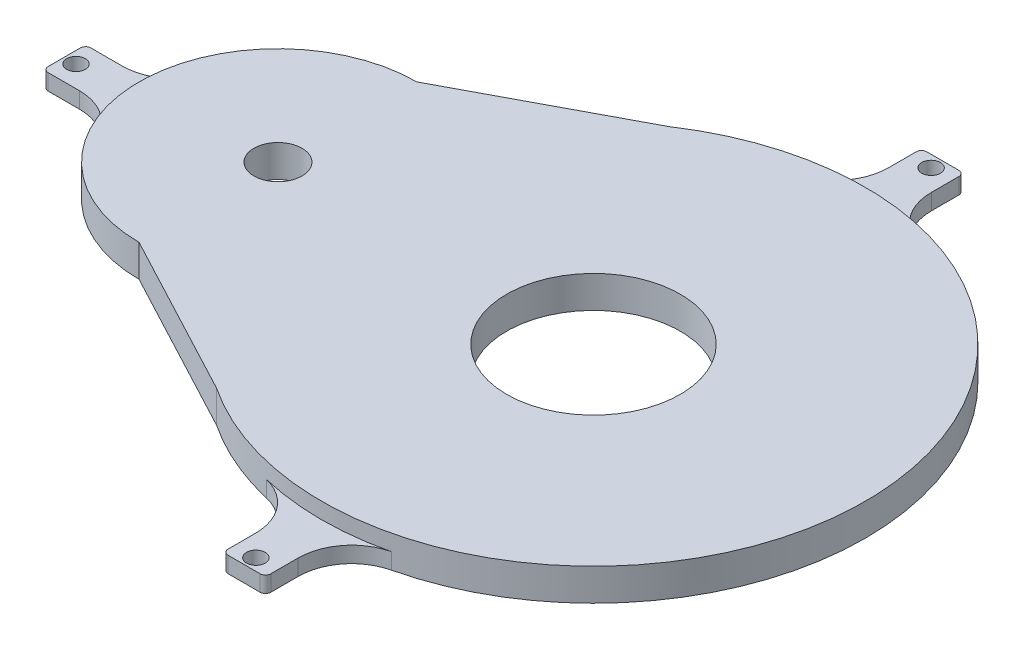
ISO-10303-21;
HEADER;
FILE_DESCRIPTION(('STEP AP214'),'2;1');
FILE_NAME('part.step','',(''),(''),'','','');
FILE_SCHEMA(('AUTOMOTIVE_DESIGN { 1 0 10303 214 1 1 1 1 }'));
ENDSEC;
DATA;
#1=APPLICATION_CONTEXT('core data for automotive mechanical design processes');
#2=APPLICATION_PROTOCOL_DEFINITION('international standard','automotive_design',2000,#1);
#3=PRODUCT_CONTEXT('',#1,'mechanical');
#4=PRODUCT('Part','Part','',(#3));
#5=PRODUCT_RELATED_PRODUCT_CATEGORY('part','',(#4));
#6=PRODUCT_DEFINITION_FORMATION('','',#4);
#7=PRODUCT_DEFINITION_CONTEXT('part definition',#1,'design');
#8=PRODUCT_DEFINITION('design','',#6,#7);
#9=PRODUCT_DEFINITION_SHAPE('','',#8);
#10=(LENGTH_UNIT() NAMED_UNIT(*) SI_UNIT(.MILLI.,.METRE.));
#11=(NAMED_UNIT(*) PLANE_ANGLE_UNIT() SI_UNIT($,.RADIAN.));
#12=(NAMED_UNIT(*) SI_UNIT($,.STERADIAN.) SOLID_ANGLE_UNIT());
#13=UNCERTAINTY_MEASURE_WITH_UNIT(LENGTH_MEASURE(1.E-05),#10,'distance_accuracy_value','');
#14=(GEOMETRIC_REPRESENTATION_CONTEXT(3) GLOBAL_UNCERTAINTY_ASSIGNED_CONTEXT((#13)) GLOBAL_UNIT_ASSIGNED_CONTEXT((#10,
#11,#12)) REPRESENTATION_CONTEXT('',''));
#15=CARTESIAN_POINT('',(0.,0.,0.));
#16=DIRECTION('',(0.,0.,1.));
#17=DIRECTION('',(1.,0.,0.));
#18=AXIS2_PLACEMENT_3D('',#15,#16,#17);
#19=CARTESIAN_POINT('',(0.,6.,0.));
#20=DIRECTION('',(0.,1.,0.));
#21=DIRECTION('',(0.,0.,1.));
#22=AXIS2_PLACEMENT_3D('',#19,#20,#21);
#23=PLANE('',#22);
#24=CARTESIAN_POINT('',(31.9089246812045,6.,-7.07485149033878));
#25=DIRECTION('',(0.,1.,0.));
#26=DIRECTION('',(0.,0.,1.));
#27=AXIS2_PLACEMENT_3D('',#24,#25,#26);
#28=CIRCLE('',#27,16.25);
#29=CARTESIAN_POINT('',(31.9089246812045,6.,9.17514850966123));
#30=VERTEX_POINT('',#29);
#31=EDGE_CURVE('E530',#30,#30,#28,.F.);
#32=ORIENTED_EDGE('',*,*,#31,.T.);
#33=EDGE_LOOP('',(#32));
#34=FACE_BOUND('',#33,.T.);
#35=CARTESIAN_POINT('',(-27.1460753187955,6.,-7.07485149033878));
#36=DIRECTION('',(0.,1.,0.));
#37=DIRECTION('',(0.,0.,1.));
#38=AXIS2_PLACEMENT_3D('',#35,#36,#37);
#39=CIRCLE('',#38,4.5);
#40=CARTESIAN_POINT('',(-27.1460753187955,6.,-2.57485149033878));
#41=VERTEX_POINT('',#40);
#42=EDGE_CURVE('E300',#41,#41,#39,.T.);
#43=ORIENTED_EDGE('',*,*,#42,.F.);
#44=EDGE_LOOP('',(#43));
#45=FACE_BOUND('',#44,.T.);
#46=CARTESIAN_POINT('',(31.9089246812045,6.,-7.07485149033878));
#47=DIRECTION('',(0.,1.,0.));
#48=DIRECTION('',(0.,0.,1.));
#49=AXIS2_PLACEMENT_3D('',#46,#47,#48);
#50=CIRCLE('',#49,50.89);
#51=CARTESIAN_POINT('',(3.70624919259435,6.,35.2855214457456));
#52=VERTEX_POINT('',#51);
#53=CARTESIAN_POINT('',(3.70624919259435,6.,-49.4352244264231));
#54=VERTEX_POINT('',#53);
#55=EDGE_CURVE('E270',#52,#54,#50,.T.);
#56=ORIENTED_EDGE('',*,*,#55,.T.);
#57=DIRECTION('',(0.883470496277917,0.,-0.468486800461283));
#58=VECTOR('',#57,1.);
#59=CARTESIAN_POINT('',(-19.6475087974022,6.,-37.051191902898));
#60=LINE('',#59,#58);
#61=CARTESIAN_POINT('',(-27.1460753187955,6.,-33.0748514903388));
#62=VERTEX_POINT('',#61);
#63=EDGE_CURVE('E274',#62,#54,#60,.T.);
#64=ORIENTED_EDGE('',*,*,#63,.F.);
#65=CARTESIAN_POINT('',(-27.1460753187955,6.,-7.07485149033878));
#66=DIRECTION('',(0.,1.,0.));
#67=DIRECTION('',(0.,0.,1.));
#68=AXIS2_PLACEMENT_3D('',#65,#66,#67);
#69=CIRCLE('',#68,26.);
#70=CARTESIAN_POINT('',(-27.1460753187955,6.,18.9251485096612));
#71=VERTEX_POINT('',#70);
#72=EDGE_CURVE('E294',#71,#62,#69,.F.);
#73=ORIENTED_EDGE('',*,*,#72,.F.);
#74=DIRECTION('',(0.883470496277918,0.,0.468486800461283));
#75=VECTOR('',#74,1.);
#76=CARTESIAN_POINT('',(-13.7910278666367,6.,26.0070640656758));
#77=LINE('',#76,#75);
#78=EDGE_CURVE('E276',#71,#52,#77,.T.);
#79=ORIENTED_EDGE('',*,*,#78,.T.);
#80=EDGE_LOOP('',(#56,#64,#73,#79));
#81=FACE_BOUND('',#80,.T.);
#82=ADVANCED_FACE('F83',(#34,#45,#81),#23,.T.);
#83=CARTESIAN_POINT('',(0.,0.,0.));
#84=DIRECTION('',(0.,1.,0.));
#85=DIRECTION('',(0.,0.,1.));
#86=AXIS2_PLACEMENT_3D('',#83,#84,#85);
#87=PLANE('',#86);
#88=CARTESIAN_POINT('',(31.9089246812045,0.,-7.07485149033878));
#89=DIRECTION('',(0.,1.,0.));
#90=DIRECTION('',(0.,0.,1.));
#91=AXIS2_PLACEMENT_3D('',#88,#89,#90);
#92=CIRCLE('',#91,16.25);
#93=CARTESIAN_POINT('',(31.9089246812045,0.,9.17514850966123));
#94=VERTEX_POINT('',#93);
#95=EDGE_CURVE('E534',#94,#94,#92,.T.);
#96=ORIENTED_EDGE('',*,*,#95,.T.);
#97=EDGE_LOOP('',(#96));
#98=FACE_BOUND('',#97,.T.);
#99=CARTESIAN_POINT('',(31.9089246812043,0.,-70.2648514903388));
#100=DIRECTION('',(0.,1.,0.));
#101=DIRECTION('',(0.,0.,1.));
#102=AXIS2_PLACEMENT_3D('',#99,#100,#101);
#103=CIRCLE('',#102,1.75);
#104=CARTESIAN_POINT('',(31.9089246812043,0.,-68.5148514903388));
#105=VERTEX_POINT('',#104);
#106=EDGE_CURVE('E466',#105,#105,#103,.T.);
#107=ORIENTED_EDGE('',*,*,#106,.T.);
#108=EDGE_LOOP('',(#107));
#109=FACE_BOUND('',#108,.T.);
#110=CARTESIAN_POINT('',(31.9089246812047,0.,56.1151485096612));
#111=DIRECTION('',(0.,1.,0.));
#112=DIRECTION('',(0.,0.,1.));
#113=AXIS2_PLACEMENT_3D('',#110,#111,#112);
#114=CIRCLE('',#113,1.75);
#115=CARTESIAN_POINT('',(31.9089246812047,0.,57.8651485096612));
#116=VERTEX_POINT('',#115);
#117=EDGE_CURVE('E479',#116,#116,#114,.T.);
#118=ORIENTED_EDGE('',*,*,#117,.T.);
#119=EDGE_LOOP('',(#118));
#120=FACE_BOUND('',#119,.T.);
#121=CARTESIAN_POINT('',(-27.1460753187955,0.,-7.07485149033878));
#122=DIRECTION('',(0.,1.,0.));
#123=DIRECTION('',(0.,0.,1.));
#124=AXIS2_PLACEMENT_3D('',#121,#122,#123);
#125=CIRCLE('',#124,4.5);
#126=CARTESIAN_POINT('',(-27.1460753187955,0.,-2.57485149033878));
#127=VERTEX_POINT('',#126);
#128=EDGE_CURVE('E278',#127,#127,#125,.T.);
#129=ORIENTED_EDGE('',*,*,#128,.T.);
#130=EDGE_LOOP('',(#129));
#131=FACE_BOUND('',#130,.T.);
#132=CARTESIAN_POINT('',(-64.9460753161257,0.,-7.07485149033877));
#133=DIRECTION('',(0.,1.,0.));
#134=DIRECTION('',(0.,0.,1.));
#135=AXIS2_PLACEMENT_3D('',#132,#133,#134);
#136=CIRCLE('',#135,1.75);
#137=CARTESIAN_POINT('',(-64.9460753161257,0.,-5.32485149033877));
#138=VERTEX_POINT('',#137);
#139=EDGE_CURVE('E491',#138,#138,#136,.T.);
#140=ORIENTED_EDGE('',*,*,#139,.T.);
#141=EDGE_LOOP('',(#140));
#142=FACE_BOUND('',#141,.T.);
#143=CARTESIAN_POINT('',(31.9089246812045,0.,-7.07485149033878));
#144=DIRECTION('',(0.,1.,0.));
#145=DIRECTION('',(0.,0.,1.));
#146=AXIS2_PLACEMENT_3D('',#143,#144,#145);
#147=CIRCLE('',#146,50.89);
#148=CARTESIAN_POINT('',(43.6096965649292,0.,42.4517478005982));
#149=VERTEX_POINT('',#148);
#150=CARTESIAN_POINT('',(43.6096965649292,0.,-56.6014507812757));
#151=VERTEX_POINT('',#150);
#152=EDGE_CURVE('E308',#149,#151,#147,.T.);
#153=ORIENTED_EDGE('',*,*,#152,.F.);
#154=CARTESIAN_POINT('',(45.9089246812045,0.,52.1838364802871));
#155=DIRECTION('',(0.,1.,0.));
#156=DIRECTION('',(0.,0.,1.));
#157=AXIS2_PLACEMENT_3D('',#154,#155,#156);
#158=CIRCLE('',#157,10.);
#159=CARTESIAN_POINT('',(35.9089246812045,0.,52.1838364802871));
#160=VERTEX_POINT('',#159);
#161=EDGE_CURVE('E421',#149,#160,#158,.T.);
#162=ORIENTED_EDGE('',*,*,#161,.T.);
#163=DIRECTION('',(0.,0.,-1.));
#164=VECTOR('',#163,1.);
#165=CARTESIAN_POINT('',(35.9089246812045,0.,0.));
#166=LINE('',#165,#164);
#167=CARTESIAN_POINT('',(35.9089246812045,0.,57.3151485096612));
#168=VERTEX_POINT('',#167);
#169=EDGE_CURVE('E482',#168,#160,#166,.T.);
#170=ORIENTED_EDGE('',*,*,#169,.F.);
#171=CARTESIAN_POINT('',(34.9089246812045,0.,57.3151485096612));
#172=DIRECTION('',(0.,1.,0.));
#173=DIRECTION('',(0.,0.,1.));
#174=AXIS2_PLACEMENT_3D('',#171,#172,#173);
#175=CIRCLE('',#174,1.);
#176=CARTESIAN_POINT('',(34.9089246812045,0.,58.3151485096612));
#177=VERTEX_POINT('',#176);
#178=EDGE_CURVE('E337',#168,#177,#175,.F.);
#179=ORIENTED_EDGE('',*,*,#178,.T.);
#180=DIRECTION('',(-1.,0.,0.));
#181=VECTOR('',#180,1.);
#182=CARTESIAN_POINT('',(0.,0.,58.3151485096612));
#183=LINE('',#182,#181);
#184=CARTESIAN_POINT('',(28.9089246812045,0.,58.3151485096612));
#185=VERTEX_POINT('',#184);
#186=EDGE_CURVE('E488',#177,#185,#183,.T.);
#187=ORIENTED_EDGE('',*,*,#186,.T.);
#188=CARTESIAN_POINT('',(28.9089246812045,0.,57.3151485096612));
#189=DIRECTION('',(0.,1.,0.));
#190=DIRECTION('',(0.,0.,1.));
#191=AXIS2_PLACEMENT_3D('',#188,#189,#190);
#192=CIRCLE('',#191,1.);
#193=CARTESIAN_POINT('',(27.9089246812045,0.,57.3151485096612));
#194=VERTEX_POINT('',#193);
#195=EDGE_CURVE('E339',#185,#194,#192,.F.);
#196=ORIENTED_EDGE('',*,*,#195,.T.);
#197=DIRECTION('',(0.,0.,-1.));
#198=VECTOR('',#197,1.);
#199=CARTESIAN_POINT('',(27.9089246812045,0.,0.));
#200=LINE('',#199,#198);
#201=CARTESIAN_POINT('',(27.9089246812045,0.,52.1838364802871));
#202=VERTEX_POINT('',#201);
#203=EDGE_CURVE('E485',#194,#202,#200,.T.);
#204=ORIENTED_EDGE('',*,*,#203,.T.);
#205=CARTESIAN_POINT('',(17.9089246812045,0.,52.1838364802871));
#206=DIRECTION('',(0.,1.,0.));
#207=DIRECTION('',(0.,0.,1.));
#208=AXIS2_PLACEMENT_3D('',#205,#206,#207);
#209=CIRCLE('',#208,10.);
#210=CARTESIAN_POINT('',(20.2081527974797,0.,42.4517478005982));
#211=VERTEX_POINT('',#210);
#212=EDGE_CURVE('E416',#202,#211,#209,.T.);
#213=ORIENTED_EDGE('',*,*,#212,.T.);
#214=CARTESIAN_POINT('',(3.70624919259435,0.,35.2855214457456));
#215=VERTEX_POINT('',#214);
#216=EDGE_CURVE('E304',#215,#211,#147,.T.);
#217=ORIENTED_EDGE('',*,*,#216,.F.);
#218=DIRECTION('',(0.883470496277918,0.,0.468486800461283));
#219=VECTOR('',#218,1.);
#220=CARTESIAN_POINT('',(-13.7910278666367,0.,26.0070640656758));
#221=LINE('',#220,#219);
#222=CARTESIAN_POINT('',(-27.1460753187955,0.,18.9251485096612));
#223=VERTEX_POINT('',#222);
#224=EDGE_CURVE('E313',#223,#215,#221,.T.);
#225=ORIENTED_EDGE('',*,*,#224,.F.);
#226=CARTESIAN_POINT('',(-27.1460753187955,0.,-7.07485149033878));
#227=DIRECTION('',(0.,1.,0.));
#228=DIRECTION('',(0.,0.,1.));
#229=AXIS2_PLACEMENT_3D('',#226,#227,#228);
#230=CIRCLE('',#229,26.);
#231=CARTESIAN_POINT('',(-51.0994765824735,0.,3.0362596207722));
#232=VERTEX_POINT('',#231);
#233=EDGE_CURVE('E311',#223,#232,#230,.F.);
#234=ORIENTED_EDGE('',*,*,#233,.T.);
#235=CARTESIAN_POINT('',(-60.3123232223496,0.,6.92514850966104));
#236=DIRECTION('',(0.,1.,0.));
#237=DIRECTION('',(0.,0.,1.));
#238=AXIS2_PLACEMENT_3D('',#235,#236,#237);
#239=CIRCLE('',#238,10.);
#240=CARTESIAN_POINT('',(-60.3123232223496,0.,-3.07485149033896));
#241=VERTEX_POINT('',#240);
#242=EDGE_CURVE('E12',#232,#241,#239,.T.);
#243=ORIENTED_EDGE('',*,*,#242,.T.);
#244=DIRECTION('',(1.,0.,0.));
#245=VECTOR('',#244,1.);
#246=CARTESIAN_POINT('',(0.,0.,-3.07485149033896));
#247=LINE('',#246,#245);
#248=CARTESIAN_POINT('',(-66.1460753161257,0.,-3.07485149033896));
#249=VERTEX_POINT('',#248);
#250=EDGE_CURVE('E494',#249,#241,#247,.T.);
#251=ORIENTED_EDGE('',*,*,#250,.F.);
#252=CARTESIAN_POINT('',(-66.1460753161257,0.,-4.07485149033896));
#253=DIRECTION('',(0.,1.,0.));
#254=DIRECTION('',(0.,0.,1.));
#255=AXIS2_PLACEMENT_3D('',#252,#253,#254);
#256=CIRCLE('',#255,1.);
#257=CARTESIAN_POINT('',(-67.1460753161257,0.,-4.07485149033896));
#258=VERTEX_POINT('',#257);
#259=EDGE_CURVE('E335',#249,#258,#256,.F.);
#260=ORIENTED_EDGE('',*,*,#259,.T.);
#261=DIRECTION('',(0.,0.,-1.));
#262=VECTOR('',#261,1.);
#263=CARTESIAN_POINT('',(-67.1460753161257,0.,0.));
#264=LINE('',#263,#262);
#265=CARTESIAN_POINT('',(-67.1460753161257,0.,-10.074851490339));
#266=VERTEX_POINT('',#265);
#267=EDGE_CURVE('E496',#258,#266,#264,.T.);
#268=ORIENTED_EDGE('',*,*,#267,.T.);
#269=CARTESIAN_POINT('',(-66.1460753161257,0.,-10.074851490339));
#270=DIRECTION('',(0.,1.,0.));
#271=DIRECTION('',(0.,0.,1.));
#272=AXIS2_PLACEMENT_3D('',#269,#270,#271);
#273=CIRCLE('',#272,1.);
#274=CARTESIAN_POINT('',(-66.1460753161257,0.,-11.074851490339));
#275=VERTEX_POINT('',#274);
#276=EDGE_CURVE('E333',#266,#275,#273,.F.);
#277=ORIENTED_EDGE('',*,*,#276,.T.);
#278=DIRECTION('',(1.,0.,0.));
#279=VECTOR('',#278,1.);
#280=CARTESIAN_POINT('',(0.,0.,-11.074851490339));
#281=LINE('',#280,#279);
#282=CARTESIAN_POINT('',(-60.3123232223494,0.,-11.074851490339));
#283=VERTEX_POINT('',#282);
#284=EDGE_CURVE('E448',#275,#283,#281,.T.);
#285=ORIENTED_EDGE('',*,*,#284,.T.);
#286=CARTESIAN_POINT('',(-60.3123232223494,0.,-21.074851490339));
#287=DIRECTION('',(0.,1.,0.));
#288=DIRECTION('',(0.,0.,1.));
#289=AXIS2_PLACEMENT_3D('',#286,#287,#288);
#290=CIRCLE('',#289,10.);
#291=CARTESIAN_POINT('',(-51.0994765824733,0.,-17.18596260145));
#292=VERTEX_POINT('',#291);
#293=EDGE_CURVE('E425',#283,#292,#290,.T.);
#294=ORIENTED_EDGE('',*,*,#293,.T.);
#295=CARTESIAN_POINT('',(-27.1460753187955,0.,-33.0748514903388));
#296=VERTEX_POINT('',#295);
#297=EDGE_CURVE('E310',#292,#296,#230,.F.);
#298=ORIENTED_EDGE('',*,*,#297,.T.);
#299=DIRECTION('',(0.883470496277917,0.,-0.468486800461283));
#300=VECTOR('',#299,1.);
#301=CARTESIAN_POINT('',(-19.6475087974022,0.,-37.051191902898));
#302=LINE('',#301,#300);
#303=CARTESIAN_POINT('',(3.70624919259435,0.,-49.4352244264231));
#304=VERTEX_POINT('',#303);
#305=EDGE_CURVE('E307',#296,#304,#302,.T.);
#306=ORIENTED_EDGE('',*,*,#305,.T.);
#307=CARTESIAN_POINT('',(20.2081527974797,0.,-56.6014507812757));
#308=VERTEX_POINT('',#307);
#309=EDGE_CURVE('E284',#308,#304,#147,.T.);
#310=ORIENTED_EDGE('',*,*,#309,.F.);
#311=CARTESIAN_POINT('',(17.9089246812045,0.,-66.3335394609647));
#312=DIRECTION('',(0.,1.,0.));
#313=DIRECTION('',(0.,0.,1.));
#314=AXIS2_PLACEMENT_3D('',#311,#312,#313);
#315=CIRCLE('',#314,10.);
#316=CARTESIAN_POINT('',(27.9089246812045,0.,-66.3335394609647));
#317=VERTEX_POINT('',#316);
#318=EDGE_CURVE('E408',#308,#317,#315,.T.);
#319=ORIENTED_EDGE('',*,*,#318,.T.);
#320=DIRECTION('',(0.,0.,1.));
#321=VECTOR('',#320,1.);
#322=CARTESIAN_POINT('',(27.9089246812045,0.,0.));
#323=LINE('',#322,#321);
#324=CARTESIAN_POINT('',(27.9089246812045,0.,-71.4648514903388));
#325=VERTEX_POINT('',#324);
#326=EDGE_CURVE('E469',#325,#317,#323,.T.);
#327=ORIENTED_EDGE('',*,*,#326,.F.);
#328=CARTESIAN_POINT('',(28.9089246812045,0.,-71.4648514903388));
#329=DIRECTION('',(0.,1.,0.));
#330=DIRECTION('',(0.,0.,1.));
#331=AXIS2_PLACEMENT_3D('',#328,#329,#330);
#332=CIRCLE('',#331,1.);
#333=CARTESIAN_POINT('',(28.9089246812045,0.,-72.4648514903388));
#334=VERTEX_POINT('',#333);
#335=EDGE_CURVE('E341',#325,#334,#332,.F.);
#336=ORIENTED_EDGE('',*,*,#335,.T.);
#337=DIRECTION('',(1.,0.,0.));
#338=VECTOR('',#337,1.);
#339=CARTESIAN_POINT('',(0.,0.,-72.4648514903388));
#340=LINE('',#339,#338);
#341=CARTESIAN_POINT('',(34.9089246812045,0.,-72.4648514903388));
#342=VERTEX_POINT('',#341);
#343=EDGE_CURVE('E476',#334,#342,#340,.T.);
#344=ORIENTED_EDGE('',*,*,#343,.T.);
#345=CARTESIAN_POINT('',(34.9089246812045,0.,-71.4648514903388));
#346=DIRECTION('',(0.,1.,0.));
#347=DIRECTION('',(0.,0.,1.));
#348=AXIS2_PLACEMENT_3D('',#345,#346,#347);
#349=CIRCLE('',#348,1.);
#350=CARTESIAN_POINT('',(35.9089246812045,0.,-71.4648514903388));
#351=VERTEX_POINT('',#350);
#352=EDGE_CURVE('E343',#342,#351,#349,.F.);
#353=ORIENTED_EDGE('',*,*,#352,.T.);
#354=DIRECTION('',(0.,0.,1.));
#355=VECTOR('',#354,1.);
#356=CARTESIAN_POINT('',(35.9089246812045,0.,0.));
#357=LINE('',#356,#355);
#358=CARTESIAN_POINT('',(35.9089246812045,0.,-66.3335394609647));
#359=VERTEX_POINT('',#358);
#360=EDGE_CURVE('E473',#351,#359,#357,.T.);
#361=ORIENTED_EDGE('',*,*,#360,.T.);
#362=CARTESIAN_POINT('',(45.9089246812045,0.,-66.3335394609647));
#363=DIRECTION('',(0.,1.,0.));
#364=DIRECTION('',(0.,0.,1.));
#365=AXIS2_PLACEMENT_3D('',#362,#363,#364);
#366=CIRCLE('',#365,10.);
#367=EDGE_CURVE('E412',#359,#151,#366,.T.);
#368=ORIENTED_EDGE('',*,*,#367,.T.);
#369=EDGE_LOOP('',(#153,#162,#170,#179,#187,#196,#204,#213,#217,#225,#234,#243,#251,#260,#268,
#277,#285,#294,#298,#306,#310,#319,#327,#336,#344,#353,#361,#368));
#370=FACE_BOUND('',#369,.T.);
#371=ADVANCED_FACE('F439',(#98,#109,#120,#131,#142,#370),#87,.F.);
#372=CARTESIAN_POINT('',(0.,0.,-3.07485149033896));
#373=DIRECTION('',(0.,0.,1.));
#374=DIRECTION('',(1.,0.,0.));
#375=AXIS2_PLACEMENT_3D('',#372,#373,#374);
#376=PLANE('',#375);
#377=ORIENTED_EDGE('',*,*,#250,.T.);
#378=DIRECTION('',(0.,1.,0.));
#379=VECTOR('',#378,1.);
#380=CARTESIAN_POINT('',(-60.3123232223496,3.,-3.07485149033896));
#381=LINE('',#380,#379);
#382=CARTESIAN_POINT('',(-60.3123232223496,3.,-3.07485149033896));
#383=VERTEX_POINT('',#382);
#384=EDGE_CURVE('E403',#241,#383,#381,.T.);
#385=ORIENTED_EDGE('',*,*,#384,.T.);
#386=DIRECTION('',(1.,0.,0.));
#387=VECTOR('',#386,1.);
#388=CARTESIAN_POINT('',(0.,3.,-3.07485149033896));
#389=LINE('',#388,#387);
#390=CARTESIAN_POINT('',(-66.1460753161257,3.,-3.07485149033896));
#391=VERTEX_POINT('',#390);
#392=EDGE_CURVE('E433',#391,#383,#389,.T.);
#393=ORIENTED_EDGE('',*,*,#392,.F.);
#394=DIRECTION('',(0.,1.,0.));
#395=VECTOR('',#394,1.);
#396=CARTESIAN_POINT('',(-66.1460753161257,0.,-3.07485149033896));
#397=LINE('',#396,#395);
#398=EDGE_CURVE('E370',#391,#249,#397,.F.);
#399=ORIENTED_EDGE('',*,*,#398,.T.);
#400=EDGE_LOOP('',(#377,#385,#393,#399));
#401=FACE_BOUND('',#400,.T.);
#402=ADVANCED_FACE('F591',(#401),#376,.T.);
#403=CARTESIAN_POINT('',(-67.1460753161257,0.,0.));
#404=DIRECTION('',(1.,0.,0.));
#405=DIRECTION('',(0.,0.,-1.));
#406=AXIS2_PLACEMENT_3D('',#403,#404,#405);
#407=PLANE('',#406);
#408=ORIENTED_EDGE('',*,*,#267,.F.);
#409=DIRECTION('',(0.,1.,0.));
#410=VECTOR('',#409,1.);
#411=CARTESIAN_POINT('',(-67.1460753161257,3.,-4.07485149033896));
#412=LINE('',#411,#410);
#413=CARTESIAN_POINT('',(-67.1460753161257,3.,-4.07485149033896));
#414=VERTEX_POINT('',#413);
#415=EDGE_CURVE('E363',#258,#414,#412,.T.);
#416=ORIENTED_EDGE('',*,*,#415,.T.);
#417=DIRECTION('',(0.,0.,-1.));
#418=VECTOR('',#417,1.);
#419=CARTESIAN_POINT('',(-67.1460753161257,3.,0.));
#420=LINE('',#419,#418);
#421=CARTESIAN_POINT('',(-67.1460753161257,3.,-10.074851490339));
#422=VERTEX_POINT('',#421);
#423=EDGE_CURVE('E458',#414,#422,#420,.T.);
#424=ORIENTED_EDGE('',*,*,#423,.T.);
#425=DIRECTION('',(0.,1.,0.));
#426=VECTOR('',#425,1.);
#427=CARTESIAN_POINT('',(-67.1460753161257,0.,-10.074851490339));
#428=LINE('',#427,#426);
#429=EDGE_CURVE('E361',#422,#266,#428,.F.);
#430=ORIENTED_EDGE('',*,*,#429,.T.);
#431=EDGE_LOOP('',(#408,#416,#424,#430));
#432=FACE_BOUND('',#431,.T.);
#433=ADVANCED_FACE('F648',(#432),#407,.F.);
#434=CARTESIAN_POINT('',(0.,0.,-11.074851490339));
#435=DIRECTION('',(0.,0.,1.));
#436=DIRECTION('',(1.,0.,0.));
#437=AXIS2_PLACEMENT_3D('',#434,#435,#436);
#438=PLANE('',#437);
#439=DIRECTION('',(1.,0.,0.));
#440=VECTOR('',#439,1.);
#441=CARTESIAN_POINT('',(0.,3.,-11.074851490339));
#442=LINE('',#441,#440);
#443=CARTESIAN_POINT('',(-66.1460753161257,3.,-11.074851490339));
#444=VERTEX_POINT('',#443);
#445=CARTESIAN_POINT('',(-60.3123232223494,3.,-11.074851490339));
#446=VERTEX_POINT('',#445);
#447=EDGE_CURVE('E454',#444,#446,#442,.T.);
#448=ORIENTED_EDGE('',*,*,#447,.T.);
#449=DIRECTION('',(0.,-1.,0.));
#450=VECTOR('',#449,1.);
#451=CARTESIAN_POINT('',(-60.3123232223494,0.,-11.074851490339));
#452=LINE('',#451,#450);
#453=EDGE_CURVE('E401',#446,#283,#452,.T.);
#454=ORIENTED_EDGE('',*,*,#453,.T.);
#455=ORIENTED_EDGE('',*,*,#284,.F.);
#456=DIRECTION('',(0.,1.,0.));
#457=VECTOR('',#456,1.);
#458=CARTESIAN_POINT('',(-66.1460753161257,0.,-11.074851490339));
#459=LINE('',#458,#457);
#460=EDGE_CURVE('E372',#275,#444,#459,.T.);
#461=ORIENTED_EDGE('',*,*,#460,.T.);
#462=EDGE_LOOP('',(#448,#454,#455,#461));
#463=FACE_BOUND('',#462,.T.);
#464=ADVANCED_FACE('F456',(#463),#438,.F.);
#465=CARTESIAN_POINT('',(-64.9460753161257,0.,-7.07485149033877));
#466=DIRECTION('',(0.,1.,0.));
#467=DIRECTION('',(0.,0.,1.));
#468=AXIS2_PLACEMENT_3D('',#465,#466,#467);
#469=CYLINDRICAL_SURFACE('',#468,1.75);
#470=ORIENTED_EDGE('',*,*,#139,.F.);
#471=EDGE_LOOP('',(#470));
#472=FACE_BOUND('',#471,.T.);
#473=CARTESIAN_POINT('',(-64.9460753161257,3.,-7.07485149033877));
#474=DIRECTION('',(0.,1.,0.));
#475=DIRECTION('',(0.,0.,1.));
#476=AXIS2_PLACEMENT_3D('',#473,#474,#475);
#477=CIRCLE('',#476,1.75);
#478=CARTESIAN_POINT('',(-64.9460753161257,3.,-5.32485149033877));
#479=VERTEX_POINT('',#478);
#480=EDGE_CURVE('E528',#479,#479,#477,.T.);
#481=ORIENTED_EDGE('',*,*,#480,.T.);
#482=EDGE_LOOP('',(#481));
#483=FACE_BOUND('',#482,.T.);
#484=ADVANCED_FACE('F596',(#472,#483),#469,.F.);
#485=CARTESIAN_POINT('',(35.9089246812045,0.,0.));
#486=DIRECTION('',(1.,0.,0.));
#487=DIRECTION('',(0.,0.,-1.));
#488=AXIS2_PLACEMENT_3D('',#485,#486,#487);
#489=PLANE('',#488);
#490=ORIENTED_EDGE('',*,*,#169,.T.);
#491=DIRECTION('',(0.,-1.,0.));
#492=VECTOR('',#491,1.);
#493=CARTESIAN_POINT('',(35.9089246812045,0.,52.1838364802871));
#494=LINE('',#493,#492);
#495=CARTESIAN_POINT('',(35.9089246812045,3.,52.1838364802871));
#496=VERTEX_POINT('',#495);
#497=EDGE_CURVE('E393',#160,#496,#494,.F.);
#498=ORIENTED_EDGE('',*,*,#497,.T.);
#499=DIRECTION('',(0.,0.,-1.));
#500=VECTOR('',#499,1.);
#501=CARTESIAN_POINT('',(35.9089246812045,3.,0.));
#502=LINE('',#501,#500);
#503=CARTESIAN_POINT('',(35.9089246812045,3.,57.3151485096612));
#504=VERTEX_POINT('',#503);
#505=EDGE_CURVE('E546',#504,#496,#502,.T.);
#506=ORIENTED_EDGE('',*,*,#505,.F.);
#507=DIRECTION('',(0.,1.,0.));
#508=VECTOR('',#507,1.);
#509=CARTESIAN_POINT('',(35.9089246812045,0.,57.3151485096612));
#510=LINE('',#509,#508);
#511=EDGE_CURVE('E359',#504,#168,#510,.F.);
#512=ORIENTED_EDGE('',*,*,#511,.T.);
#513=EDGE_LOOP('',(#490,#498,#506,#512));
#514=FACE_BOUND('',#513,.T.);
#515=ADVANCED_FACE('F637',(#514),#489,.T.);
#516=CARTESIAN_POINT('',(0.,0.,58.3151485096612));
#517=DIRECTION('',(0.,0.,-1.));
#518=DIRECTION('',(-1.,0.,0.));
#519=AXIS2_PLACEMENT_3D('',#516,#517,#518);
#520=PLANE('',#519);
#521=DIRECTION('',(1.,0.,0.));
#522=VECTOR('',#521,1.);
#523=CARTESIAN_POINT('',(0.,3.,58.3151485096612));
#524=LINE('',#523,#522);
#525=CARTESIAN_POINT('',(28.9089246812045,3.,58.3151485096612));
#526=VERTEX_POINT('',#525);
#527=CARTESIAN_POINT('',(34.9089246812045,3.,58.3151485096612));
#528=VERTEX_POINT('',#527);
#529=EDGE_CURVE('E543',#526,#528,#524,.T.);
#530=ORIENTED_EDGE('',*,*,#529,.F.);
#531=DIRECTION('',(0.,1.,0.));
#532=VECTOR('',#531,1.);
#533=CARTESIAN_POINT('',(28.9089246812045,0.,58.3151485096612));
#534=LINE('',#533,#532);
#535=EDGE_CURVE('E357',#526,#185,#534,.F.);
#536=ORIENTED_EDGE('',*,*,#535,.T.);
#537=ORIENTED_EDGE('',*,*,#186,.F.);
#538=DIRECTION('',(0.,1.,0.));
#539=VECTOR('',#538,1.);
#540=CARTESIAN_POINT('',(34.9089246812045,3.,58.3151485096612));
#541=LINE('',#540,#539);
#542=EDGE_CURVE('E354',#177,#528,#541,.T.);
#543=ORIENTED_EDGE('',*,*,#542,.T.);
#544=EDGE_LOOP('',(#530,#536,#537,#543));
#545=FACE_BOUND('',#544,.T.);
#546=ADVANCED_FACE('F633',(#545),#520,.F.);
#547=CARTESIAN_POINT('',(27.9089246812045,0.,0.));
#548=DIRECTION('',(1.,0.,0.));
#549=DIRECTION('',(0.,0.,-1.));
#550=AXIS2_PLACEMENT_3D('',#547,#548,#549);
#551=PLANE('',#550);
#552=DIRECTION('',(0.,0.,-1.));
#553=VECTOR('',#552,1.);
#554=CARTESIAN_POINT('',(27.9089246812045,3.,0.));
#555=LINE('',#554,#553);
#556=CARTESIAN_POINT('',(27.9089246812045,3.,57.3151485096612));
#557=VERTEX_POINT('',#556);
#558=CARTESIAN_POINT('',(27.9089246812045,3.,52.1838364802871));
#559=VERTEX_POINT('',#558);
#560=EDGE_CURVE('E522',#557,#559,#555,.T.);
#561=ORIENTED_EDGE('',*,*,#560,.T.);
#562=DIRECTION('',(0.,1.,0.));
#563=VECTOR('',#562,1.);
#564=CARTESIAN_POINT('',(27.9089246812045,0.,52.1838364802871));
#565=LINE('',#564,#563);
#566=EDGE_CURVE('E391',#559,#202,#565,.F.);
#567=ORIENTED_EDGE('',*,*,#566,.T.);
#568=ORIENTED_EDGE('',*,*,#203,.F.);
#569=DIRECTION('',(0.,1.,0.));
#570=VECTOR('',#569,1.);
#571=CARTESIAN_POINT('',(27.9089246812045,0.,57.3151485096612));
#572=LINE('',#571,#570);
#573=EDGE_CURVE('E347',#194,#557,#572,.T.);
#574=ORIENTED_EDGE('',*,*,#573,.T.);
#575=EDGE_LOOP('',(#561,#567,#568,#574));
#576=FACE_BOUND('',#575,.T.);
#577=ADVANCED_FACE('F636',(#576),#551,.F.);
#578=CARTESIAN_POINT('',(31.9089246812047,0.,56.1151485096612));
#579=DIRECTION('',(0.,1.,0.));
#580=DIRECTION('',(0.,0.,1.));
#581=AXIS2_PLACEMENT_3D('',#578,#579,#580);
#582=CYLINDRICAL_SURFACE('',#581,1.75);
#583=ORIENTED_EDGE('',*,*,#117,.F.);
#584=EDGE_LOOP('',(#583));
#585=FACE_BOUND('',#584,.T.);
#586=CARTESIAN_POINT('',(31.9089246812047,3.,56.1151485096612));
#587=DIRECTION('',(0.,1.,0.));
#588=DIRECTION('',(0.,0.,1.));
#589=AXIS2_PLACEMENT_3D('',#586,#587,#588);
#590=CIRCLE('',#589,1.75);
#591=CARTESIAN_POINT('',(31.9089246812047,3.,57.8651485096612));
#592=VERTEX_POINT('',#591);
#593=EDGE_CURVE('E470',#592,#592,#590,.T.);
#594=ORIENTED_EDGE('',*,*,#593,.T.);
#595=EDGE_LOOP('',(#594));
#596=FACE_BOUND('',#595,.T.);
#597=ADVANCED_FACE('F631',(#585,#596),#582,.F.);
#598=CARTESIAN_POINT('',(27.9089246812045,0.,0.));
#599=DIRECTION('',(-1.,0.,0.));
#600=DIRECTION('',(0.,0.,1.));
#601=AXIS2_PLACEMENT_3D('',#598,#599,#600);
#602=PLANE('',#601);
#603=ORIENTED_EDGE('',*,*,#326,.T.);
#604=DIRECTION('',(0.,-1.,0.));
#605=VECTOR('',#604,1.);
#606=CARTESIAN_POINT('',(27.9089246812045,0.,-66.3335394609647));
#607=LINE('',#606,#605);
#608=CARTESIAN_POINT('',(27.9089246812045,3.,-66.3335394609647));
#609=VERTEX_POINT('',#608);
#610=EDGE_CURVE('E375',#317,#609,#607,.F.);
#611=ORIENTED_EDGE('',*,*,#610,.T.);
#612=DIRECTION('',(0.,0.,1.));
#613=VECTOR('',#612,1.);
#614=CARTESIAN_POINT('',(27.9089246812045,3.,0.));
#615=LINE('',#614,#613);
#616=CARTESIAN_POINT('',(27.9089246812045,3.,-71.4648514903388));
#617=VERTEX_POINT('',#616);
#618=EDGE_CURVE('E524',#617,#609,#615,.T.);
#619=ORIENTED_EDGE('',*,*,#618,.F.);
#620=DIRECTION('',(0.,1.,0.));
#621=VECTOR('',#620,1.);
#622=CARTESIAN_POINT('',(27.9089246812045,0.,-71.4648514903388));
#623=LINE('',#622,#621);
#624=EDGE_CURVE('E345',#617,#325,#623,.F.);
#625=ORIENTED_EDGE('',*,*,#624,.T.);
#626=EDGE_LOOP('',(#603,#611,#619,#625));
#627=FACE_BOUND('',#626,.T.);
#628=ADVANCED_FACE('F560',(#627),#602,.T.);
#629=CARTESIAN_POINT('',(0.,0.,-72.4648514903388));
#630=DIRECTION('',(0.,0.,1.));
#631=DIRECTION('',(1.,0.,0.));
#632=AXIS2_PLACEMENT_3D('',#629,#630,#631);
#633=PLANE('',#632);
#634=DIRECTION('',(1.,0.,0.));
#635=VECTOR('',#634,1.);
#636=CARTESIAN_POINT('',(0.,3.,-72.4648514903388));
#637=LINE('',#636,#635);
#638=CARTESIAN_POINT('',(28.9089246812045,3.,-72.4648514903388));
#639=VERTEX_POINT('',#638);
#640=CARTESIAN_POINT('',(34.9089246812045,3.,-72.4648514903388));
#641=VERTEX_POINT('',#640);
#642=EDGE_CURVE('E519',#639,#641,#637,.T.);
#643=ORIENTED_EDGE('',*,*,#642,.T.);
#644=DIRECTION('',(0.,1.,0.));
#645=VECTOR('',#644,1.);
#646=CARTESIAN_POINT('',(34.9089246812045,0.,-72.4648514903388));
#647=LINE('',#646,#645);
#648=EDGE_CURVE('E331',#641,#342,#647,.F.);
#649=ORIENTED_EDGE('',*,*,#648,.T.);
#650=ORIENTED_EDGE('',*,*,#343,.F.);
#651=DIRECTION('',(0.,1.,0.));
#652=VECTOR('',#651,1.);
#653=CARTESIAN_POINT('',(28.9089246812045,3.,-72.4648514903388));
#654=LINE('',#653,#652);
#655=EDGE_CURVE('E328',#334,#639,#654,.T.);
#656=ORIENTED_EDGE('',*,*,#655,.T.);
#657=EDGE_LOOP('',(#643,#649,#650,#656));
#658=FACE_BOUND('',#657,.T.);
#659=ADVANCED_FACE('F570',(#658),#633,.F.);
#660=CARTESIAN_POINT('',(35.9089246812045,0.,0.));
#661=DIRECTION('',(-1.,0.,0.));
#662=DIRECTION('',(0.,0.,1.));
#663=AXIS2_PLACEMENT_3D('',#660,#661,#662);
#664=PLANE('',#663);
#665=DIRECTION('',(0.,0.,1.));
#666=VECTOR('',#665,1.);
#667=CARTESIAN_POINT('',(35.9089246812045,3.,0.));
#668=LINE('',#667,#666);
#669=CARTESIAN_POINT('',(35.9089246812045,3.,-71.4648514903388));
#670=VERTEX_POINT('',#669);
#671=CARTESIAN_POINT('',(35.9089246812045,3.,-66.3335394609647));
#672=VERTEX_POINT('',#671);
#673=EDGE_CURVE('E513',#670,#672,#668,.T.);
#674=ORIENTED_EDGE('',*,*,#673,.T.);
#675=DIRECTION('',(0.,1.,0.));
#676=VECTOR('',#675,1.);
#677=CARTESIAN_POINT('',(35.9089246812045,0.,-66.3335394609647));
#678=LINE('',#677,#676);
#679=EDGE_CURVE('E383',#672,#359,#678,.F.);
#680=ORIENTED_EDGE('',*,*,#679,.T.);
#681=ORIENTED_EDGE('',*,*,#360,.F.);
#682=DIRECTION('',(0.,1.,0.));
#683=VECTOR('',#682,1.);
#684=CARTESIAN_POINT('',(35.9089246812045,0.,-71.4648514903388));
#685=LINE('',#684,#683);
#686=EDGE_CURVE('E288',#351,#670,#685,.T.);
#687=ORIENTED_EDGE('',*,*,#686,.T.);
#688=EDGE_LOOP('',(#674,#680,#681,#687));
#689=FACE_BOUND('',#688,.T.);
#690=ADVANCED_FACE('F516',(#689),#664,.F.);
#691=CARTESIAN_POINT('',(31.9089246812043,0.,-70.2648514903388));
#692=DIRECTION('',(0.,1.,0.));
#693=DIRECTION('',(0.,0.,1.));
#694=AXIS2_PLACEMENT_3D('',#691,#692,#693);
#695=CYLINDRICAL_SURFACE('',#694,1.75);
#696=ORIENTED_EDGE('',*,*,#106,.F.);
#697=EDGE_LOOP('',(#696));
#698=FACE_BOUND('',#697,.T.);
#699=CARTESIAN_POINT('',(31.9089246812043,3.,-70.2648514903388));
#700=DIRECTION('',(0.,1.,0.));
#701=DIRECTION('',(0.,0.,1.));
#702=AXIS2_PLACEMENT_3D('',#699,#700,#701);
#703=CIRCLE('',#702,1.75);
#704=CARTESIAN_POINT('',(31.9089246812043,3.,-68.5148514903388));
#705=VERTEX_POINT('',#704);
#706=EDGE_CURVE('E461',#705,#705,#703,.T.);
#707=ORIENTED_EDGE('',*,*,#706,.T.);
#708=EDGE_LOOP('',(#707));
#709=FACE_BOUND('',#708,.T.);
#710=ADVANCED_FACE('F603',(#698,#709),#695,.F.);
#711=CARTESIAN_POINT('',(31.9089246812045,6.,-7.07485149033878));
#712=DIRECTION('',(0.,-1.,0.));
#713=DIRECTION('',(0.,0.,-1.));
#714=AXIS2_PLACEMENT_3D('',#711,#712,#713);
#715=CYLINDRICAL_SURFACE('',#714,50.89);
#716=CARTESIAN_POINT('',(31.9089246812045,3.,-7.07485149033878));
#717=DIRECTION('',(0.,1.,0.));
#718=DIRECTION('',(0.,0.,1.));
#719=AXIS2_PLACEMENT_3D('',#716,#717,#718);
#720=CIRCLE('',#719,50.89);
#721=CARTESIAN_POINT('',(43.6096965649292,3.,-56.6014507812757));
#722=VERTEX_POINT('',#721);
#723=CARTESIAN_POINT('',(20.2081527974797,3.,-56.6014507812757));
#724=VERTEX_POINT('',#723);
#725=EDGE_CURVE('E514',#722,#724,#720,.T.);
#726=ORIENTED_EDGE('',*,*,#725,.T.);
#727=DIRECTION('',(0.,-1.,0.));
#728=VECTOR('',#727,1.);
#729=CARTESIAN_POINT('',(20.2081527974797,6.,-56.6014507812757));
#730=LINE('',#729,#728);
#731=EDGE_CURVE('E381',#724,#308,#730,.T.);
#732=ORIENTED_EDGE('',*,*,#731,.T.);
#733=ORIENTED_EDGE('',*,*,#309,.T.);
#734=DIRECTION('',(0.,-1.,0.));
#735=VECTOR('',#734,1.);
#736=CARTESIAN_POINT('',(3.70624919259435,6.,-49.4352244264231));
#737=LINE('',#736,#735);
#738=EDGE_CURVE('E281',#54,#304,#737,.T.);
#739=ORIENTED_EDGE('',*,*,#738,.F.);
#740=ORIENTED_EDGE('',*,*,#55,.F.);
#741=DIRECTION('',(0.,-1.,0.));
#742=VECTOR('',#741,1.);
#743=CARTESIAN_POINT('',(3.70624919259435,6.,35.2855214457456));
#744=LINE('',#743,#742);
#745=EDGE_CURVE('E303',#52,#215,#744,.T.);
#746=ORIENTED_EDGE('',*,*,#745,.T.);
#747=ORIENTED_EDGE('',*,*,#216,.T.);
#748=DIRECTION('',(0.,-1.,0.));
#749=VECTOR('',#748,1.);
#750=CARTESIAN_POINT('',(20.2081527974797,6.,42.4517478005982));
#751=LINE('',#750,#749);
#752=CARTESIAN_POINT('',(20.2081527974797,3.,42.4517478005982));
#753=VERTEX_POINT('',#752);
#754=EDGE_CURVE('E388',#211,#753,#751,.F.);
#755=ORIENTED_EDGE('',*,*,#754,.T.);
#756=CARTESIAN_POINT('',(31.9089246812045,3.,-7.07485149033878));
#757=DIRECTION('',(0.,1.,0.));
#758=DIRECTION('',(0.,0.,1.));
#759=AXIS2_PLACEMENT_3D('',#756,#757,#758);
#760=CIRCLE('',#759,50.89);
#761=CARTESIAN_POINT('',(43.6096965649292,3.,42.4517478005982));
#762=VERTEX_POINT('',#761);
#763=EDGE_CURVE('E549',#753,#762,#760,.T.);
#764=ORIENTED_EDGE('',*,*,#763,.T.);
#765=DIRECTION('',(0.,-1.,0.));
#766=VECTOR('',#765,1.);
#767=CARTESIAN_POINT('',(43.6096965649292,6.,42.4517478005982));
#768=LINE('',#767,#766);
#769=EDGE_CURVE('E385',#762,#149,#768,.T.);
#770=ORIENTED_EDGE('',*,*,#769,.T.);
#771=ORIENTED_EDGE('',*,*,#152,.T.);
#772=DIRECTION('',(0.,-1.,0.));
#773=VECTOR('',#772,1.);
#774=CARTESIAN_POINT('',(43.6096965649292,6.,-56.6014507812757));
#775=LINE('',#774,#773);
#776=EDGE_CURVE('E378',#151,#722,#775,.F.);
#777=ORIENTED_EDGE('',*,*,#776,.T.);
#778=EDGE_LOOP('',(#726,#732,#733,#739,#740,#746,#747,#755,#764,#770,#771,#777));
#779=FACE_BOUND('',#778,.T.);
#780=ADVANCED_FACE('F282',(#779),#715,.T.);
#781=CARTESIAN_POINT('',(-27.1460753187955,6.,-7.07485149033878));
#782=DIRECTION('',(0.,-1.,0.));
#783=DIRECTION('',(0.,0.,-1.));
#784=AXIS2_PLACEMENT_3D('',#781,#782,#783);
#785=CYLINDRICAL_SURFACE('',#784,4.5);
#786=ORIENTED_EDGE('',*,*,#42,.T.);
#787=EDGE_LOOP('',(#786));
#788=FACE_BOUND('',#787,.T.);
#789=ORIENTED_EDGE('',*,*,#128,.F.);
#790=EDGE_LOOP('',(#789));
#791=FACE_BOUND('',#790,.T.);
#792=ADVANCED_FACE('F599',(#788,#791),#785,.F.);
#793=CARTESIAN_POINT('',(-19.6475087974022,6.,-37.051191902898));
#794=DIRECTION('',(-0.468486800461283,0.,-0.883470496277917));
#795=DIRECTION('',(-0.883470496277917,0.,0.468486800461283));
#796=AXIS2_PLACEMENT_3D('',#793,#794,#795);
#797=PLANE('',#796);
#798=ORIENTED_EDGE('',*,*,#305,.F.);
#799=DIRECTION('',(0.,-1.,0.));
#800=VECTOR('',#799,1.);
#801=CARTESIAN_POINT('',(-27.1460753187955,6.,-33.0748514903388));
#802=LINE('',#801,#800);
#803=EDGE_CURVE('E289',#62,#296,#802,.T.);
#804=ORIENTED_EDGE('',*,*,#803,.F.);
#805=ORIENTED_EDGE('',*,*,#63,.T.);
#806=ORIENTED_EDGE('',*,*,#738,.T.);
#807=EDGE_LOOP('',(#798,#804,#805,#806));
#808=FACE_BOUND('',#807,.T.);
#809=ADVANCED_FACE('F292',(#808),#797,.T.);
#810=CARTESIAN_POINT('',(-27.1460753187955,6.,-7.07485149033878));
#811=DIRECTION('',(0.,-1.,0.));
#812=DIRECTION('',(0.,0.,-1.));
#813=AXIS2_PLACEMENT_3D('',#810,#811,#812);
#814=CYLINDRICAL_SURFACE('',#813,26.);
#815=ORIENTED_EDGE('',*,*,#297,.F.);
#816=DIRECTION('',(0.,-1.,0.));
#817=VECTOR('',#816,1.);
#818=CARTESIAN_POINT('',(-51.0994765824733,6.,-17.18596260145));
#819=LINE('',#818,#817);
#820=CARTESIAN_POINT('',(-51.0994765824733,3.,-17.18596260145));
#821=VERTEX_POINT('',#820);
#822=EDGE_CURVE('E398',#292,#821,#819,.F.);
#823=ORIENTED_EDGE('',*,*,#822,.T.);
#824=CARTESIAN_POINT('',(-27.1460753187955,3.,-7.07485149033878));
#825=DIRECTION('',(0.,1.,0.));
#826=DIRECTION('',(0.,0.,1.));
#827=AXIS2_PLACEMENT_3D('',#824,#825,#826);
#828=CIRCLE('',#827,26.);
#829=CARTESIAN_POINT('',(-51.0994765824735,3.,3.0362596207722));
#830=VERTEX_POINT('',#829);
#831=EDGE_CURVE('E430',#821,#830,#828,.T.);
#832=ORIENTED_EDGE('',*,*,#831,.T.);
#833=DIRECTION('',(0.,-1.,0.));
#834=VECTOR('',#833,1.);
#835=CARTESIAN_POINT('',(-51.0994765824735,6.,3.0362596207722));
#836=LINE('',#835,#834);
#837=EDGE_CURVE('E396',#830,#232,#836,.T.);
#838=ORIENTED_EDGE('',*,*,#837,.T.);
#839=ORIENTED_EDGE('',*,*,#233,.F.);
#840=DIRECTION('',(0.,-1.,0.));
#841=VECTOR('',#840,1.);
#842=CARTESIAN_POINT('',(-27.1460753187955,6.,18.9251485096612));
#843=LINE('',#842,#841);
#844=EDGE_CURVE('E319',#71,#223,#843,.T.);
#845=ORIENTED_EDGE('',*,*,#844,.F.);
#846=ORIENTED_EDGE('',*,*,#72,.T.);
#847=ORIENTED_EDGE('',*,*,#803,.T.);
#848=EDGE_LOOP('',(#815,#823,#832,#838,#839,#845,#846,#847));
#849=FACE_BOUND('',#848,.T.);
#850=ADVANCED_FACE('F437',(#849),#814,.T.);
#851=CARTESIAN_POINT('',(-13.7910278666367,6.,26.0070640656758));
#852=DIRECTION('',(0.468486800461283,0.,-0.883470496277918));
#853=DIRECTION('',(-0.883470496277918,0.,-0.468486800461283));
#854=AXIS2_PLACEMENT_3D('',#851,#852,#853);
#855=PLANE('',#854);
#856=ORIENTED_EDGE('',*,*,#224,.T.);
#857=ORIENTED_EDGE('',*,*,#745,.F.);
#858=ORIENTED_EDGE('',*,*,#78,.F.);
#859=ORIENTED_EDGE('',*,*,#844,.T.);
#860=EDGE_LOOP('',(#856,#857,#858,#859));
#861=FACE_BOUND('',#860,.T.);
#862=ADVANCED_FACE('F442',(#861),#855,.F.);
#863=CARTESIAN_POINT('',(0.,3.,0.));
#864=DIRECTION('',(0.,1.,0.));
#865=DIRECTION('',(0.,0.,1.));
#866=AXIS2_PLACEMENT_3D('',#863,#864,#865);
#867=PLANE('',#866);
#868=ORIENTED_EDGE('',*,*,#706,.F.);
#869=EDGE_LOOP('',(#868));
#870=FACE_BOUND('',#869,.T.);
#871=ORIENTED_EDGE('',*,*,#673,.F.);
#872=CARTESIAN_POINT('',(34.9089246812045,3.,-71.4648514903388));
#873=DIRECTION('',(0.,1.,0.));
#874=DIRECTION('',(0.,0.,1.));
#875=AXIS2_PLACEMENT_3D('',#872,#873,#874);
#876=CIRCLE('',#875,1.);
#877=EDGE_CURVE('E326',#670,#641,#876,.T.);
#878=ORIENTED_EDGE('',*,*,#877,.T.);
#879=ORIENTED_EDGE('',*,*,#642,.F.);
#880=CARTESIAN_POINT('',(28.9089246812045,3.,-71.4648514903388));
#881=DIRECTION('',(0.,1.,0.));
#882=DIRECTION('',(0.,0.,1.));
#883=AXIS2_PLACEMENT_3D('',#880,#881,#882);
#884=CIRCLE('',#883,1.);
#885=EDGE_CURVE('E324',#639,#617,#884,.T.);
#886=ORIENTED_EDGE('',*,*,#885,.T.);
#887=ORIENTED_EDGE('',*,*,#618,.T.);
#888=CARTESIAN_POINT('',(17.9089246812045,3.,-66.3335394609647));
#889=DIRECTION('',(0.,1.,0.));
#890=DIRECTION('',(0.,0.,1.));
#891=AXIS2_PLACEMENT_3D('',#888,#889,#890);
#892=CIRCLE('',#891,10.);
#893=EDGE_CURVE('E405',#609,#724,#892,.F.);
#894=ORIENTED_EDGE('',*,*,#893,.T.);
#895=ORIENTED_EDGE('',*,*,#725,.F.);
#896=CARTESIAN_POINT('',(45.9089246812045,3.,-66.3335394609647));
#897=DIRECTION('',(0.,1.,0.));
#898=DIRECTION('',(0.,0.,1.));
#899=AXIS2_PLACEMENT_3D('',#896,#897,#898);
#900=CIRCLE('',#899,10.);
#901=EDGE_CURVE('E410',#722,#672,#900,.F.);
#902=ORIENTED_EDGE('',*,*,#901,.T.);
#903=EDGE_LOOP('',(#871,#878,#879,#886,#887,#894,#895,#902));
#904=FACE_BOUND('',#903,.T.);
#905=ADVANCED_FACE('F512',(#870,#904),#867,.T.);
#906=CARTESIAN_POINT('',(0.,3.,0.));
#907=DIRECTION('',(0.,1.,0.));
#908=DIRECTION('',(0.,0.,1.));
#909=AXIS2_PLACEMENT_3D('',#906,#907,#908);
#910=PLANE('',#909);
#911=ORIENTED_EDGE('',*,*,#560,.F.);
#912=CARTESIAN_POINT('',(28.9089246812045,3.,57.3151485096612));
#913=DIRECTION('',(0.,1.,0.));
#914=DIRECTION('',(0.,0.,1.));
#915=AXIS2_PLACEMENT_3D('',#912,#913,#914);
#916=CIRCLE('',#915,1.);
#917=EDGE_CURVE('E352',#557,#526,#916,.T.);
#918=ORIENTED_EDGE('',*,*,#917,.T.);
#919=ORIENTED_EDGE('',*,*,#529,.T.);
#920=CARTESIAN_POINT('',(34.9089246812045,3.,57.3151485096612));
#921=DIRECTION('',(0.,1.,0.));
#922=DIRECTION('',(0.,0.,1.));
#923=AXIS2_PLACEMENT_3D('',#920,#921,#922);
#924=CIRCLE('',#923,1.);
#925=EDGE_CURVE('E350',#528,#504,#924,.T.);
#926=ORIENTED_EDGE('',*,*,#925,.T.);
#927=ORIENTED_EDGE('',*,*,#505,.T.);
#928=CARTESIAN_POINT('',(45.9089246812045,3.,52.1838364802871));
#929=DIRECTION('',(0.,1.,0.));
#930=DIRECTION('',(0.,0.,1.));
#931=AXIS2_PLACEMENT_3D('',#928,#929,#930);
#932=CIRCLE('',#931,10.);
#933=EDGE_CURVE('E418',#496,#762,#932,.F.);
#934=ORIENTED_EDGE('',*,*,#933,.T.);
#935=ORIENTED_EDGE('',*,*,#763,.F.);
#936=CARTESIAN_POINT('',(17.9089246812045,3.,52.1838364802871));
#937=DIRECTION('',(0.,1.,0.));
#938=DIRECTION('',(0.,0.,1.));
#939=AXIS2_PLACEMENT_3D('',#936,#937,#938);
#940=CIRCLE('',#939,10.);
#941=EDGE_CURVE('E414',#753,#559,#940,.F.);
#942=ORIENTED_EDGE('',*,*,#941,.T.);
#943=EDGE_LOOP('',(#911,#918,#919,#926,#927,#934,#935,#942));
#944=FACE_BOUND('',#943,.T.);
#945=ORIENTED_EDGE('',*,*,#593,.F.);
#946=EDGE_LOOP('',(#945));
#947=FACE_BOUND('',#946,.T.);
#948=ADVANCED_FACE('F582',(#944,#947),#910,.T.);
#949=CARTESIAN_POINT('',(0.,3.,0.));
#950=DIRECTION('',(0.,1.,0.));
#951=DIRECTION('',(0.,0.,1.));
#952=AXIS2_PLACEMENT_3D('',#949,#950,#951);
#953=PLANE('',#952);
#954=ORIENTED_EDGE('',*,*,#480,.F.);
#955=EDGE_LOOP('',(#954));
#956=FACE_BOUND('',#955,.T.);
#957=ORIENTED_EDGE('',*,*,#423,.F.);
#958=CARTESIAN_POINT('',(-66.1460753161257,3.,-4.07485149033896));
#959=DIRECTION('',(0.,1.,0.));
#960=DIRECTION('',(0.,0.,1.));
#961=AXIS2_PLACEMENT_3D('',#958,#959,#960);
#962=CIRCLE('',#961,1.);
#963=EDGE_CURVE('E368',#414,#391,#962,.T.);
#964=ORIENTED_EDGE('',*,*,#963,.T.);
#965=ORIENTED_EDGE('',*,*,#392,.T.);
#966=CARTESIAN_POINT('',(-60.3123232223496,3.,6.92514850966104));
#967=DIRECTION('',(0.,1.,0.));
#968=DIRECTION('',(0.,0.,1.));
#969=AXIS2_PLACEMENT_3D('',#966,#967,#968);
#970=CIRCLE('',#969,10.);
#971=EDGE_CURVE('E91',#383,#830,#970,.F.);
#972=ORIENTED_EDGE('',*,*,#971,.T.);
#973=ORIENTED_EDGE('',*,*,#831,.F.);
#974=CARTESIAN_POINT('',(-60.3123232223494,3.,-21.074851490339));
#975=DIRECTION('',(0.,1.,0.));
#976=DIRECTION('',(0.,0.,1.));
#977=AXIS2_PLACEMENT_3D('',#974,#975,#976);
#978=CIRCLE('',#977,10.);
#979=EDGE_CURVE('E423',#821,#446,#978,.F.);
#980=ORIENTED_EDGE('',*,*,#979,.T.);
#981=ORIENTED_EDGE('',*,*,#447,.F.);
#982=CARTESIAN_POINT('',(-66.1460753161257,3.,-10.074851490339));
#983=DIRECTION('',(0.,1.,0.));
#984=DIRECTION('',(0.,0.,1.));
#985=AXIS2_PLACEMENT_3D('',#982,#983,#984);
#986=CIRCLE('',#985,1.);
#987=EDGE_CURVE('E366',#444,#422,#986,.T.);
#988=ORIENTED_EDGE('',*,*,#987,.T.);
#989=EDGE_LOOP('',(#957,#964,#965,#972,#973,#980,#981,#988));
#990=FACE_BOUND('',#989,.T.);
#991=ADVANCED_FACE('F429',(#956,#990),#953,.T.);
#992=CARTESIAN_POINT('',(34.9089246812045,0.,-71.4648514903388));
#993=DIRECTION('',(0.,1.,0.));
#994=DIRECTION('',(0.,0.,1.));
#995=AXIS2_PLACEMENT_3D('',#992,#993,#994);
#996=CYLINDRICAL_SURFACE('',#995,1.);
#997=ORIENTED_EDGE('',*,*,#352,.F.);
#998=ORIENTED_EDGE('',*,*,#648,.F.);
#999=ORIENTED_EDGE('',*,*,#877,.F.);
#1000=ORIENTED_EDGE('',*,*,#686,.F.);
#1001=EDGE_LOOP('',(#997,#998,#999,#1000));
#1002=FACE_BOUND('',#1001,.T.);
#1003=ADVANCED_FACE('F573',(#1002),#996,.T.);
#1004=CARTESIAN_POINT('',(28.9089246812045,0.,-71.4648514903388));
#1005=DIRECTION('',(0.,-1.,0.));
#1006=DIRECTION('',(0.,0.,-1.));
#1007=AXIS2_PLACEMENT_3D('',#1004,#1005,#1006);
#1008=CYLINDRICAL_SURFACE('',#1007,1.);
#1009=ORIENTED_EDGE('',*,*,#335,.F.);
#1010=ORIENTED_EDGE('',*,*,#624,.F.);
#1011=ORIENTED_EDGE('',*,*,#885,.F.);
#1012=ORIENTED_EDGE('',*,*,#655,.F.);
#1013=EDGE_LOOP('',(#1009,#1010,#1011,#1012));
#1014=FACE_BOUND('',#1013,.T.);
#1015=ADVANCED_FACE('F565',(#1014),#1008,.T.);
#1016=CARTESIAN_POINT('',(28.9089246812045,0.,57.3151485096612));
#1017=DIRECTION('',(0.,1.,0.));
#1018=DIRECTION('',(0.,0.,1.));
#1019=AXIS2_PLACEMENT_3D('',#1016,#1017,#1018);
#1020=CYLINDRICAL_SURFACE('',#1019,1.);
#1021=ORIENTED_EDGE('',*,*,#195,.F.);
#1022=ORIENTED_EDGE('',*,*,#535,.F.);
#1023=ORIENTED_EDGE('',*,*,#917,.F.);
#1024=ORIENTED_EDGE('',*,*,#573,.F.);
#1025=EDGE_LOOP('',(#1021,#1022,#1023,#1024));
#1026=FACE_BOUND('',#1025,.T.);
#1027=ADVANCED_FACE('F580',(#1026),#1020,.T.);
#1028=CARTESIAN_POINT('',(34.9089246812045,0.,57.3151485096612));
#1029=DIRECTION('',(0.,-1.,0.));
#1030=DIRECTION('',(0.,0.,-1.));
#1031=AXIS2_PLACEMENT_3D('',#1028,#1029,#1030);
#1032=CYLINDRICAL_SURFACE('',#1031,1.);
#1033=ORIENTED_EDGE('',*,*,#178,.F.);
#1034=ORIENTED_EDGE('',*,*,#511,.F.);
#1035=ORIENTED_EDGE('',*,*,#925,.F.);
#1036=ORIENTED_EDGE('',*,*,#542,.F.);
#1037=EDGE_LOOP('',(#1033,#1034,#1035,#1036));
#1038=FACE_BOUND('',#1037,.T.);
#1039=ADVANCED_FACE('F674',(#1038),#1032,.T.);
#1040=CARTESIAN_POINT('',(-66.1460753161257,0.,-4.07485149033896));
#1041=DIRECTION('',(0.,-1.,0.));
#1042=DIRECTION('',(0.,0.,-1.));
#1043=AXIS2_PLACEMENT_3D('',#1040,#1041,#1042);
#1044=CYLINDRICAL_SURFACE('',#1043,1.);
#1045=ORIENTED_EDGE('',*,*,#259,.F.);
#1046=ORIENTED_EDGE('',*,*,#398,.F.);
#1047=ORIENTED_EDGE('',*,*,#963,.F.);
#1048=ORIENTED_EDGE('',*,*,#415,.F.);
#1049=EDGE_LOOP('',(#1045,#1046,#1047,#1048));
#1050=FACE_BOUND('',#1049,.T.);
#1051=ADVANCED_FACE('F661',(#1050),#1044,.T.);
#1052=CARTESIAN_POINT('',(-66.1460753161257,0.,-10.074851490339));
#1053=DIRECTION('',(0.,1.,0.));
#1054=DIRECTION('',(0.,0.,1.));
#1055=AXIS2_PLACEMENT_3D('',#1052,#1053,#1054);
#1056=CYLINDRICAL_SURFACE('',#1055,1.);
#1057=ORIENTED_EDGE('',*,*,#276,.F.);
#1058=ORIENTED_EDGE('',*,*,#429,.F.);
#1059=ORIENTED_EDGE('',*,*,#987,.F.);
#1060=ORIENTED_EDGE('',*,*,#460,.F.);
#1061=EDGE_LOOP('',(#1057,#1058,#1059,#1060));
#1062=FACE_BOUND('',#1061,.T.);
#1063=ADVANCED_FACE('F664',(#1062),#1056,.T.);
#1064=CARTESIAN_POINT('',(17.9089246812045,6.,-66.3335394609647));
#1065=DIRECTION('',(0.,-1.,0.));
#1066=DIRECTION('',(0.,0.,-1.));
#1067=AXIS2_PLACEMENT_3D('',#1064,#1065,#1066);
#1068=CYLINDRICAL_SURFACE('',#1067,10.);
#1069=ORIENTED_EDGE('',*,*,#318,.F.);
#1070=ORIENTED_EDGE('',*,*,#731,.F.);
#1071=ORIENTED_EDGE('',*,*,#893,.F.);
#1072=ORIENTED_EDGE('',*,*,#610,.F.);
#1073=EDGE_LOOP('',(#1069,#1070,#1071,#1072));
#1074=FACE_BOUND('',#1073,.T.);
#1075=ADVANCED_FACE('F666',(#1074),#1068,.F.);
#1076=CARTESIAN_POINT('',(45.9089246812045,6.,-66.3335394609647));
#1077=DIRECTION('',(0.,-1.,0.));
#1078=DIRECTION('',(0.,0.,-1.));
#1079=AXIS2_PLACEMENT_3D('',#1076,#1077,#1078);
#1080=CYLINDRICAL_SURFACE('',#1079,10.);
#1081=ORIENTED_EDGE('',*,*,#367,.F.);
#1082=ORIENTED_EDGE('',*,*,#679,.F.);
#1083=ORIENTED_EDGE('',*,*,#901,.F.);
#1084=ORIENTED_EDGE('',*,*,#776,.F.);
#1085=EDGE_LOOP('',(#1081,#1082,#1083,#1084));
#1086=FACE_BOUND('',#1085,.T.);
#1087=ADVANCED_FACE('F507',(#1086),#1080,.F.);
#1088=CARTESIAN_POINT('',(17.9089246812045,6.,52.1838364802871));
#1089=DIRECTION('',(0.,-1.,0.));
#1090=DIRECTION('',(0.,0.,-1.));
#1091=AXIS2_PLACEMENT_3D('',#1088,#1089,#1090);
#1092=CYLINDRICAL_SURFACE('',#1091,10.);
#1093=ORIENTED_EDGE('',*,*,#212,.F.);
#1094=ORIENTED_EDGE('',*,*,#566,.F.);
#1095=ORIENTED_EDGE('',*,*,#941,.F.);
#1096=ORIENTED_EDGE('',*,*,#754,.F.);
#1097=EDGE_LOOP('',(#1093,#1094,#1095,#1096));
#1098=FACE_BOUND('',#1097,.T.);
#1099=ADVANCED_FACE('F680',(#1098),#1092,.F.);
#1100=CARTESIAN_POINT('',(45.9089246812045,6.,52.1838364802871));
#1101=DIRECTION('',(0.,-1.,0.));
#1102=DIRECTION('',(0.,0.,-1.));
#1103=AXIS2_PLACEMENT_3D('',#1100,#1101,#1102);
#1104=CYLINDRICAL_SURFACE('',#1103,10.);
#1105=ORIENTED_EDGE('',*,*,#161,.F.);
#1106=ORIENTED_EDGE('',*,*,#769,.F.);
#1107=ORIENTED_EDGE('',*,*,#933,.F.);
#1108=ORIENTED_EDGE('',*,*,#497,.F.);
#1109=EDGE_LOOP('',(#1105,#1106,#1107,#1108));
#1110=FACE_BOUND('',#1109,.T.);
#1111=ADVANCED_FACE('F683',(#1110),#1104,.F.);
#1112=CARTESIAN_POINT('',(-60.3123232223494,6.,-21.074851490339));
#1113=DIRECTION('',(0.,-1.,0.));
#1114=DIRECTION('',(0.,0.,-1.));
#1115=AXIS2_PLACEMENT_3D('',#1112,#1113,#1114);
#1116=CYLINDRICAL_SURFACE('',#1115,10.);
#1117=ORIENTED_EDGE('',*,*,#293,.F.);
#1118=ORIENTED_EDGE('',*,*,#453,.F.);
#1119=ORIENTED_EDGE('',*,*,#979,.F.);
#1120=ORIENTED_EDGE('',*,*,#822,.F.);
#1121=EDGE_LOOP('',(#1117,#1118,#1119,#1120));
#1122=FACE_BOUND('',#1121,.T.);
#1123=ADVANCED_FACE('F451',(#1122),#1116,.F.);
#1124=CARTESIAN_POINT('',(-60.3123232223496,6.,6.92514850966104));
#1125=DIRECTION('',(0.,-1.,0.));
#1126=DIRECTION('',(0.,0.,-1.));
#1127=AXIS2_PLACEMENT_3D('',#1124,#1125,#1126);
#1128=CYLINDRICAL_SURFACE('',#1127,10.);
#1129=ORIENTED_EDGE('',*,*,#242,.F.);
#1130=ORIENTED_EDGE('',*,*,#837,.F.);
#1131=ORIENTED_EDGE('',*,*,#971,.F.);
#1132=ORIENTED_EDGE('',*,*,#384,.F.);
#1133=EDGE_LOOP('',(#1129,#1130,#1131,#1132));
#1134=FACE_BOUND('',#1133,.T.);
#1135=ADVANCED_FACE('F85',(#1134),#1128,.F.);
#1136=CARTESIAN_POINT('',(31.9089246812045,10.,-7.07485149033878));
#1137=DIRECTION('',(0.,-1.,0.));
#1138=DIRECTION('',(0.,0.,-1.));
#1139=AXIS2_PLACEMENT_3D('',#1136,#1137,#1138);
#1140=CYLINDRICAL_SURFACE('',#1139,16.25);
#1141=ORIENTED_EDGE('',*,*,#31,.F.);
#1142=EDGE_LOOP('',(#1141));
#1143=FACE_BOUND('',#1142,.T.);
#1144=ORIENTED_EDGE('',*,*,#95,.F.);
#1145=EDGE_LOOP('',(#1144));
#1146=FACE_BOUND('',#1145,.T.);
#1147=ADVANCED_FACE('F691',(#1143,#1146),#1140,.F.);
#1148=CLOSED_SHELL('',(#82,#371,#402,#433,#464,#484,#515,#546,#577,#597,#628,#659,#690,#710,
#780,#792,#809,#850,#862,#905,#948,#991,#1003,#1015,#1027,#1039,#1051,#1063,#1075,#1087,#1099,
#1111,#1123,#1135,#1147));
#1149=MANIFOLD_SOLID_BREP('B2',#1148);
#1150=ADVANCED_BREP_SHAPE_REPRESENTATION('',(#18,#1149),#14);
#1151=SHAPE_DEFINITION_REPRESENTATION(#9,#1150);
ENDSEC;
END-ISO-10303-21;
